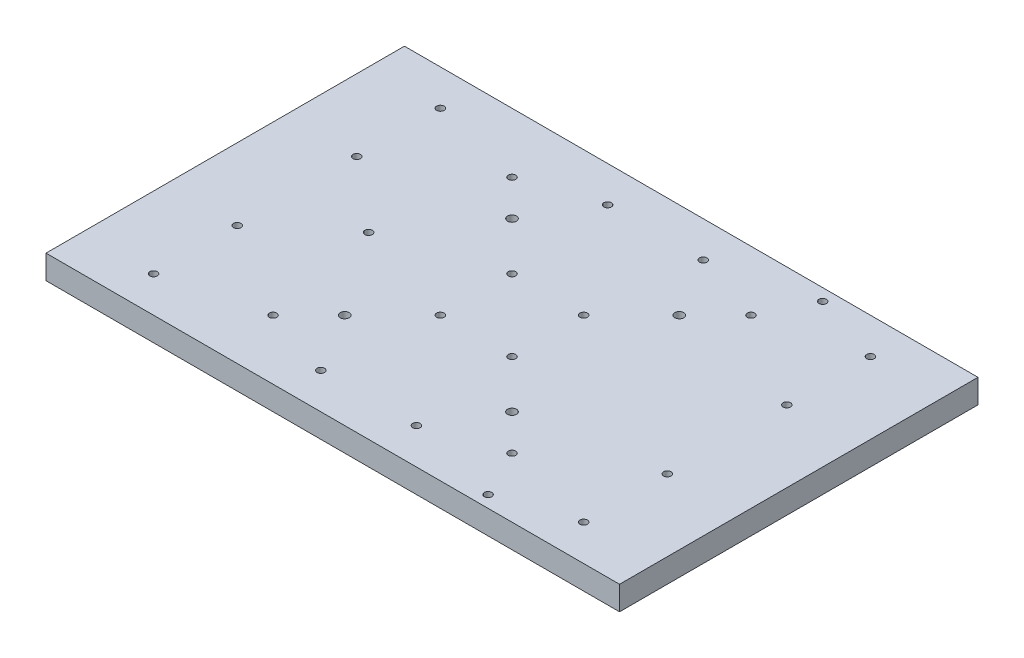
ISO-10303-21;
HEADER;
FILE_DESCRIPTION(('STEP AP214'),'2;1');
FILE_NAME('part.step','',(''),(''),'','','');
FILE_SCHEMA(('AUTOMOTIVE_DESIGN { 1 0 10303 214 1 1 1 1 }'));
ENDSEC;
DATA;
#1=APPLICATION_CONTEXT('core data for automotive mechanical design processes');
#2=APPLICATION_PROTOCOL_DEFINITION('international standard','automotive_design',2000,#1);
#3=PRODUCT_CONTEXT('',#1,'mechanical');
#4=PRODUCT('Part','Part','',(#3));
#5=PRODUCT_RELATED_PRODUCT_CATEGORY('part','',(#4));
#6=PRODUCT_DEFINITION_FORMATION('','',#4);
#7=PRODUCT_DEFINITION_CONTEXT('part definition',#1,'design');
#8=PRODUCT_DEFINITION('design','',#6,#7);
#9=PRODUCT_DEFINITION_SHAPE('','',#8);
#10=(LENGTH_UNIT() NAMED_UNIT(*) SI_UNIT(.MILLI.,.METRE.));
#11=(NAMED_UNIT(*) PLANE_ANGLE_UNIT() SI_UNIT($,.RADIAN.));
#12=(NAMED_UNIT(*) SI_UNIT($,.STERADIAN.) SOLID_ANGLE_UNIT());
#13=UNCERTAINTY_MEASURE_WITH_UNIT(LENGTH_MEASURE(1.E-05),#10,'distance_accuracy_value','');
#14=(GEOMETRIC_REPRESENTATION_CONTEXT(3) GLOBAL_UNCERTAINTY_ASSIGNED_CONTEXT((#13)) GLOBAL_UNIT_ASSIGNED_CONTEXT((#10,
#11,#12)) REPRESENTATION_CONTEXT('',''));
#15=CARTESIAN_POINT('',(0.,0.,0.));
#16=DIRECTION('',(0.,0.,1.));
#17=DIRECTION('',(1.,0.,0.));
#18=AXIS2_PLACEMENT_3D('',#15,#16,#17);
#19=CARTESIAN_POINT('',(304.8,12.7,-190.5));
#20=DIRECTION('',(-1.,0.,0.));
#21=DIRECTION('',(0.,0.,1.));
#22=AXIS2_PLACEMENT_3D('',#19,#20,#21);
#23=PLANE('',#22);
#24=DIRECTION('',(0.,0.,-1.));
#25=VECTOR('',#24,1.);
#26=CARTESIAN_POINT('',(304.8,-12.7,-190.5));
#27=LINE('',#26,#25);
#28=CARTESIAN_POINT('',(304.8,-12.7,190.5));
#29=VERTEX_POINT('',#28);
#30=CARTESIAN_POINT('',(304.8,-12.7,-190.5));
#31=VERTEX_POINT('',#30);
#32=EDGE_CURVE('E98',#29,#31,#27,.T.);
#33=ORIENTED_EDGE('',*,*,#32,.T.);
#34=DIRECTION('',(0.,-1.,0.));
#35=VECTOR('',#34,1.);
#36=CARTESIAN_POINT('',(304.8,12.7,-190.5));
#37=LINE('',#36,#35);
#38=CARTESIAN_POINT('',(304.8,12.7,-190.5));
#39=VERTEX_POINT('',#38);
#40=EDGE_CURVE('E11',#39,#31,#37,.T.);
#41=ORIENTED_EDGE('',*,*,#40,.F.);
#42=DIRECTION('',(0.,0.,-1.));
#43=VECTOR('',#42,1.);
#44=CARTESIAN_POINT('',(304.8,12.7,-190.5));
#45=LINE('',#44,#43);
#46=CARTESIAN_POINT('',(304.8,12.7,190.5));
#47=VERTEX_POINT('',#46);
#48=EDGE_CURVE('E86',#47,#39,#45,.T.);
#49=ORIENTED_EDGE('',*,*,#48,.F.);
#50=DIRECTION('',(0.,-1.,0.));
#51=VECTOR('',#50,1.);
#52=CARTESIAN_POINT('',(304.8,12.7,190.5));
#53=LINE('',#52,#51);
#54=EDGE_CURVE('E94',#47,#29,#53,.T.);
#55=ORIENTED_EDGE('',*,*,#54,.T.);
#56=EDGE_LOOP('',(#33,#41,#49,#55));
#57=FACE_BOUND('',#56,.T.);
#58=ADVANCED_FACE('F35',(#57),#23,.F.);
#59=CARTESIAN_POINT('',(-304.8,12.7,-190.5));
#60=DIRECTION('',(0.,0.,1.));
#61=DIRECTION('',(1.,0.,0.));
#62=AXIS2_PLACEMENT_3D('',#59,#60,#61);
#63=PLANE('',#62);
#64=DIRECTION('',(-1.,0.,0.));
#65=VECTOR('',#64,1.);
#66=CARTESIAN_POINT('',(-304.8,-12.7,-190.5));
#67=LINE('',#66,#65);
#68=CARTESIAN_POINT('',(-304.8,-12.7,-190.5));
#69=VERTEX_POINT('',#68);
#70=EDGE_CURVE('E90',#31,#69,#67,.T.);
#71=ORIENTED_EDGE('',*,*,#70,.T.);
#72=DIRECTION('',(0.,-1.,0.));
#73=VECTOR('',#72,1.);
#74=CARTESIAN_POINT('',(-304.8,12.7,-190.5));
#75=LINE('',#74,#73);
#76=CARTESIAN_POINT('',(-304.8,12.7,-190.5));
#77=VERTEX_POINT('',#76);
#78=EDGE_CURVE('E43',#77,#69,#75,.T.);
#79=ORIENTED_EDGE('',*,*,#78,.F.);
#80=DIRECTION('',(-1.,0.,0.));
#81=VECTOR('',#80,1.);
#82=CARTESIAN_POINT('',(-304.8,12.7,-190.5));
#83=LINE('',#82,#81);
#84=EDGE_CURVE('E81',#39,#77,#83,.T.);
#85=ORIENTED_EDGE('',*,*,#84,.F.);
#86=ORIENTED_EDGE('',*,*,#40,.T.);
#87=EDGE_LOOP('',(#71,#79,#85,#86));
#88=FACE_BOUND('',#87,.T.);
#89=ADVANCED_FACE('F89',(#88),#63,.F.);
#90=CARTESIAN_POINT('',(-304.8,12.7,-190.5));
#91=DIRECTION('',(1.,0.,0.));
#92=DIRECTION('',(0.,0.,-1.));
#93=AXIS2_PLACEMENT_3D('',#90,#91,#92);
#94=PLANE('',#93);
#95=DIRECTION('',(0.,0.,1.));
#96=VECTOR('',#95,1.);
#97=CARTESIAN_POINT('',(-304.8,-12.7,-190.5));
#98=LINE('',#97,#96);
#99=CARTESIAN_POINT('',(-304.8,-12.7,190.5));
#100=VERTEX_POINT('',#99);
#101=EDGE_CURVE('E68',#69,#100,#98,.T.);
#102=ORIENTED_EDGE('',*,*,#101,.T.);
#103=DIRECTION('',(0.,-1.,0.));
#104=VECTOR('',#103,1.);
#105=CARTESIAN_POINT('',(-304.8,12.7,190.5));
#106=LINE('',#105,#104);
#107=CARTESIAN_POINT('',(-304.8,12.7,190.5));
#108=VERTEX_POINT('',#107);
#109=EDGE_CURVE('E91',#108,#100,#106,.T.);
#110=ORIENTED_EDGE('',*,*,#109,.F.);
#111=DIRECTION('',(0.,0.,1.));
#112=VECTOR('',#111,1.);
#113=CARTESIAN_POINT('',(-304.8,12.7,-190.5));
#114=LINE('',#113,#112);
#115=EDGE_CURVE('E84',#77,#108,#114,.T.);
#116=ORIENTED_EDGE('',*,*,#115,.F.);
#117=ORIENTED_EDGE('',*,*,#78,.T.);
#118=EDGE_LOOP('',(#102,#110,#116,#117));
#119=FACE_BOUND('',#118,.T.);
#120=ADVANCED_FACE('F92',(#119),#94,.F.);
#121=CARTESIAN_POINT('',(-304.8,12.7,190.5));
#122=DIRECTION('',(0.,0.,-1.));
#123=DIRECTION('',(-1.,0.,0.));
#124=AXIS2_PLACEMENT_3D('',#121,#122,#123);
#125=PLANE('',#124);
#126=DIRECTION('',(1.,0.,0.));
#127=VECTOR('',#126,1.);
#128=CARTESIAN_POINT('',(-304.8,-12.7,190.5));
#129=LINE('',#128,#127);
#130=EDGE_CURVE('E74',#100,#29,#129,.T.);
#131=ORIENTED_EDGE('',*,*,#130,.T.);
#132=ORIENTED_EDGE('',*,*,#54,.F.);
#133=DIRECTION('',(1.,0.,0.));
#134=VECTOR('',#133,1.);
#135=CARTESIAN_POINT('',(-304.8,12.7,190.5));
#136=LINE('',#135,#134);
#137=EDGE_CURVE('E51',#108,#47,#136,.T.);
#138=ORIENTED_EDGE('',*,*,#137,.F.);
#139=ORIENTED_EDGE('',*,*,#109,.T.);
#140=EDGE_LOOP('',(#131,#132,#138,#139));
#141=FACE_BOUND('',#140,.T.);
#142=ADVANCED_FACE('F106',(#141),#125,.F.);
#143=CARTESIAN_POINT('',(0.,12.7,0.));
#144=DIRECTION('',(0.,1.,0.));
#145=DIRECTION('',(0.,0.,1.));
#146=AXIS2_PLACEMENT_3D('',#143,#144,#145);
#147=PLANE('',#146);
#148=CARTESIAN_POINT('',(-127.,12.7,127.));
#149=DIRECTION('',(0.,1.,0.));
#150=DIRECTION('',(0.,0.,1.));
#151=AXIS2_PLACEMENT_3D('',#148,#149,#150);
#152=CIRCLE('',#151,3.96874999999999);
#153=CARTESIAN_POINT('',(-127.,12.7,130.96875));
#154=VERTEX_POINT('',#153);
#155=EDGE_CURVE('E270',#154,#154,#152,.T.);
#156=ORIENTED_EDGE('',*,*,#155,.F.);
#157=EDGE_LOOP('',(#156));
#158=FACE_BOUND('',#157,.T.);
#159=CARTESIAN_POINT('',(-38.1,12.7,38.1));
#160=DIRECTION('',(0.,1.,0.));
#161=DIRECTION('',(0.,0.,1.));
#162=AXIS2_PLACEMENT_3D('',#159,#160,#161);
#163=CIRCLE('',#162,3.96874999999999);
#164=CARTESIAN_POINT('',(-38.1,12.7,42.06875));
#165=VERTEX_POINT('',#164);
#166=EDGE_CURVE('E264',#165,#165,#163,.T.);
#167=ORIENTED_EDGE('',*,*,#166,.F.);
#168=EDGE_LOOP('',(#167));
#169=FACE_BOUND('',#168,.T.);
#170=CARTESIAN_POINT('',(-228.6,12.7,63.5));
#171=DIRECTION('',(0.,1.,0.));
#172=DIRECTION('',(0.,0.,1.));
#173=AXIS2_PLACEMENT_3D('',#170,#171,#172);
#174=CIRCLE('',#173,3.96874999999999);
#175=CARTESIAN_POINT('',(-228.6,12.7,67.46875));
#176=VERTEX_POINT('',#175);
#177=EDGE_CURVE('E258',#176,#176,#174,.T.);
#178=ORIENTED_EDGE('',*,*,#177,.F.);
#179=EDGE_LOOP('',(#178));
#180=FACE_BOUND('',#179,.T.);
#181=CARTESIAN_POINT('',(-228.6,12.7,152.4));
#182=DIRECTION('',(0.,1.,0.));
#183=DIRECTION('',(0.,0.,1.));
#184=AXIS2_PLACEMENT_3D('',#181,#182,#183);
#185=CIRCLE('',#184,3.96874999999999);
#186=CARTESIAN_POINT('',(-228.6,12.7,156.36875));
#187=VERTEX_POINT('',#186);
#188=EDGE_CURVE('E252',#187,#187,#185,.T.);
#189=ORIENTED_EDGE('',*,*,#188,.F.);
#190=EDGE_LOOP('',(#189));
#191=FACE_BOUND('',#190,.T.);
#192=CARTESIAN_POINT('',(-50.8,12.7,152.4));
#193=DIRECTION('',(0.,1.,0.));
#194=DIRECTION('',(0.,0.,1.));
#195=AXIS2_PLACEMENT_3D('',#192,#193,#194);
#196=CIRCLE('',#195,3.96874999999999);
#197=CARTESIAN_POINT('',(-50.8,12.7,156.36875));
#198=VERTEX_POINT('',#197);
#199=EDGE_CURVE('E246',#198,#198,#196,.T.);
#200=ORIENTED_EDGE('',*,*,#199,.F.);
#201=EDGE_LOOP('',(#200));
#202=FACE_BOUND('',#201,.T.);
#203=CARTESIAN_POINT('',(-88.9,12.7,88.9));
#204=DIRECTION('',(0.,1.,0.));
#205=DIRECTION('',(0.,0.,-1.));
#206=AXIS2_PLACEMENT_3D('',#203,#204,#205);
#207=CIRCLE('',#206,4.7625);
#208=CARTESIAN_POINT('',(-88.9,12.7,84.1375));
#209=VERTEX_POINT('',#208);
#210=EDGE_CURVE('E238',#209,#209,#207,.T.);
#211=ORIENTED_EDGE('',*,*,#210,.F.);
#212=EDGE_LOOP('',(#211));
#213=FACE_BOUND('',#212,.T.);
#214=CARTESIAN_POINT('',(-127.,12.7,-127.));
#215=DIRECTION('',(0.,1.,0.));
#216=DIRECTION('',(0.,0.,1.));
#217=AXIS2_PLACEMENT_3D('',#214,#215,#216);
#218=CIRCLE('',#217,3.96874999999999);
#219=CARTESIAN_POINT('',(-127.,12.7,-123.03125));
#220=VERTEX_POINT('',#219);
#221=EDGE_CURVE('E234',#220,#220,#218,.T.);
#222=ORIENTED_EDGE('',*,*,#221,.F.);
#223=EDGE_LOOP('',(#222));
#224=FACE_BOUND('',#223,.T.);
#225=CARTESIAN_POINT('',(-38.1,12.7,-38.1));
#226=DIRECTION('',(0.,1.,0.));
#227=DIRECTION('',(0.,0.,1.));
#228=AXIS2_PLACEMENT_3D('',#225,#226,#227);
#229=CIRCLE('',#228,3.96874999999999);
#230=CARTESIAN_POINT('',(-38.1,12.7,-34.13125));
#231=VERTEX_POINT('',#230);
#232=EDGE_CURVE('E228',#231,#231,#229,.T.);
#233=ORIENTED_EDGE('',*,*,#232,.F.);
#234=EDGE_LOOP('',(#233));
#235=FACE_BOUND('',#234,.T.);
#236=CARTESIAN_POINT('',(-228.6,12.7,-63.5));
#237=DIRECTION('',(0.,1.,0.));
#238=DIRECTION('',(0.,0.,1.));
#239=AXIS2_PLACEMENT_3D('',#236,#237,#238);
#240=CIRCLE('',#239,3.96874999999999);
#241=CARTESIAN_POINT('',(-228.6,12.7,-59.53125));
#242=VERTEX_POINT('',#241);
#243=EDGE_CURVE('E222',#242,#242,#240,.T.);
#244=ORIENTED_EDGE('',*,*,#243,.F.);
#245=EDGE_LOOP('',(#244));
#246=FACE_BOUND('',#245,.T.);
#247=CARTESIAN_POINT('',(-228.6,12.7,-152.4));
#248=DIRECTION('',(0.,1.,0.));
#249=DIRECTION('',(0.,0.,1.));
#250=AXIS2_PLACEMENT_3D('',#247,#248,#249);
#251=CIRCLE('',#250,3.96874999999999);
#252=CARTESIAN_POINT('',(-228.6,12.7,-148.43125));
#253=VERTEX_POINT('',#252);
#254=EDGE_CURVE('E216',#253,#253,#251,.T.);
#255=ORIENTED_EDGE('',*,*,#254,.F.);
#256=EDGE_LOOP('',(#255));
#257=FACE_BOUND('',#256,.T.);
#258=CARTESIAN_POINT('',(-50.8,12.7,-152.4));
#259=DIRECTION('',(0.,1.,0.));
#260=DIRECTION('',(0.,0.,1.));
#261=AXIS2_PLACEMENT_3D('',#258,#259,#260);
#262=CIRCLE('',#261,3.96874999999999);
#263=CARTESIAN_POINT('',(-50.8,12.7,-148.43125));
#264=VERTEX_POINT('',#263);
#265=EDGE_CURVE('E210',#264,#264,#262,.T.);
#266=ORIENTED_EDGE('',*,*,#265,.F.);
#267=EDGE_LOOP('',(#266));
#268=FACE_BOUND('',#267,.T.);
#269=CARTESIAN_POINT('',(-88.9,12.7,-88.9));
#270=DIRECTION('',(0.,-1.,0.));
#271=DIRECTION('',(0.,0.,1.));
#272=AXIS2_PLACEMENT_3D('',#269,#270,#271);
#273=CIRCLE('',#272,4.7625);
#274=CARTESIAN_POINT('',(-88.9,12.7,-84.1375));
#275=VERTEX_POINT('',#274);
#276=EDGE_CURVE('E202',#275,#275,#273,.T.);
#277=ORIENTED_EDGE('',*,*,#276,.T.);
#278=EDGE_LOOP('',(#277));
#279=FACE_BOUND('',#278,.T.);
#280=CARTESIAN_POINT('',(127.,12.7,127.));
#281=DIRECTION('',(0.,1.,0.));
#282=DIRECTION('',(0.,0.,1.));
#283=AXIS2_PLACEMENT_3D('',#280,#281,#282);
#284=CIRCLE('',#283,3.96874999999999);
#285=CARTESIAN_POINT('',(127.,12.7,130.96875));
#286=VERTEX_POINT('',#285);
#287=EDGE_CURVE('E198',#286,#286,#284,.T.);
#288=ORIENTED_EDGE('',*,*,#287,.F.);
#289=EDGE_LOOP('',(#288));
#290=FACE_BOUND('',#289,.T.);
#291=CARTESIAN_POINT('',(38.1,12.7,38.1));
#292=DIRECTION('',(0.,1.,0.));
#293=DIRECTION('',(0.,0.,1.));
#294=AXIS2_PLACEMENT_3D('',#291,#292,#293);
#295=CIRCLE('',#294,3.96874999999999);
#296=CARTESIAN_POINT('',(38.1,12.7,42.06875));
#297=VERTEX_POINT('',#296);
#298=EDGE_CURVE('E192',#297,#297,#295,.T.);
#299=ORIENTED_EDGE('',*,*,#298,.F.);
#300=EDGE_LOOP('',(#299));
#301=FACE_BOUND('',#300,.T.);
#302=CARTESIAN_POINT('',(228.6,12.7,63.5));
#303=DIRECTION('',(0.,1.,0.));
#304=DIRECTION('',(0.,0.,1.));
#305=AXIS2_PLACEMENT_3D('',#302,#303,#304);
#306=CIRCLE('',#305,3.96874999999999);
#307=CARTESIAN_POINT('',(228.6,12.7,67.46875));
#308=VERTEX_POINT('',#307);
#309=EDGE_CURVE('E186',#308,#308,#306,.T.);
#310=ORIENTED_EDGE('',*,*,#309,.F.);
#311=EDGE_LOOP('',(#310));
#312=FACE_BOUND('',#311,.T.);
#313=CARTESIAN_POINT('',(228.6,12.7,152.4));
#314=DIRECTION('',(0.,1.,0.));
#315=DIRECTION('',(0.,0.,1.));
#316=AXIS2_PLACEMENT_3D('',#313,#314,#315);
#317=CIRCLE('',#316,3.96874999999999);
#318=CARTESIAN_POINT('',(228.6,12.7,156.36875));
#319=VERTEX_POINT('',#318);
#320=EDGE_CURVE('E180',#319,#319,#317,.T.);
#321=ORIENTED_EDGE('',*,*,#320,.F.);
#322=EDGE_LOOP('',(#321));
#323=FACE_BOUND('',#322,.T.);
#324=CARTESIAN_POINT('',(50.8,12.7,152.4));
#325=DIRECTION('',(0.,1.,0.));
#326=DIRECTION('',(0.,0.,1.));
#327=AXIS2_PLACEMENT_3D('',#324,#325,#326);
#328=CIRCLE('',#327,3.96874999999999);
#329=CARTESIAN_POINT('',(50.8,12.7,156.36875));
#330=VERTEX_POINT('',#329);
#331=EDGE_CURVE('E174',#330,#330,#328,.T.);
#332=ORIENTED_EDGE('',*,*,#331,.F.);
#333=EDGE_LOOP('',(#332));
#334=FACE_BOUND('',#333,.T.);
#335=CARTESIAN_POINT('',(88.9,12.7,88.9));
#336=DIRECTION('',(0.,-1.,0.));
#337=DIRECTION('',(0.,0.,-1.));
#338=AXIS2_PLACEMENT_3D('',#335,#336,#337);
#339=CIRCLE('',#338,4.7625);
#340=CARTESIAN_POINT('',(88.9,12.7,84.1375));
#341=VERTEX_POINT('',#340);
#342=EDGE_CURVE('E166',#341,#341,#339,.T.);
#343=ORIENTED_EDGE('',*,*,#342,.T.);
#344=EDGE_LOOP('',(#343));
#345=FACE_BOUND('',#344,.T.);
#346=CARTESIAN_POINT('',(152.4,12.7,-177.8));
#347=DIRECTION('',(0.,1.,0.));
#348=DIRECTION('',(0.,0.,1.));
#349=AXIS2_PLACEMENT_3D('',#346,#347,#348);
#350=CIRCLE('',#349,3.96874999999999);
#351=CARTESIAN_POINT('',(152.4,12.7,-173.83125));
#352=VERTEX_POINT('',#351);
#353=EDGE_CURVE('E162',#352,#352,#350,.T.);
#354=ORIENTED_EDGE('',*,*,#353,.F.);
#355=EDGE_LOOP('',(#354));
#356=FACE_BOUND('',#355,.T.);
#357=CARTESIAN_POINT('',(152.4,12.7,177.8));
#358=DIRECTION('',(0.,1.,0.));
#359=DIRECTION('',(0.,0.,1.));
#360=AXIS2_PLACEMENT_3D('',#357,#358,#359);
#361=CIRCLE('',#360,3.96874999999999);
#362=CARTESIAN_POINT('',(152.4,12.7,181.76875));
#363=VERTEX_POINT('',#362);
#364=EDGE_CURVE('E156',#363,#363,#361,.T.);
#365=ORIENTED_EDGE('',*,*,#364,.F.);
#366=EDGE_LOOP('',(#365));
#367=FACE_BOUND('',#366,.T.);
#368=CARTESIAN_POINT('',(-152.4,12.7,0.));
#369=DIRECTION('',(0.,1.,0.));
#370=DIRECTION('',(0.,0.,1.));
#371=AXIS2_PLACEMENT_3D('',#368,#369,#370);
#372=CIRCLE('',#371,3.96874999999999);
#373=CARTESIAN_POINT('',(-152.4,12.7,3.96874999999999));
#374=VERTEX_POINT('',#373);
#375=EDGE_CURVE('E150',#374,#374,#372,.T.);
#376=ORIENTED_EDGE('',*,*,#375,.F.);
#377=EDGE_LOOP('',(#376));
#378=FACE_BOUND('',#377,.T.);
#379=CARTESIAN_POINT('',(127.,12.7,-127.));
#380=DIRECTION('',(0.,1.,0.));
#381=DIRECTION('',(0.,0.,1.));
#382=AXIS2_PLACEMENT_3D('',#379,#380,#381);
#383=CIRCLE('',#382,3.96874999999999);
#384=CARTESIAN_POINT('',(127.,12.7,-123.03125));
#385=VERTEX_POINT('',#384);
#386=EDGE_CURVE('E144',#385,#385,#383,.T.);
#387=ORIENTED_EDGE('',*,*,#386,.F.);
#388=EDGE_LOOP('',(#387));
#389=FACE_BOUND('',#388,.T.);
#390=CARTESIAN_POINT('',(38.1,12.7,-38.1));
#391=DIRECTION('',(0.,1.,0.));
#392=DIRECTION('',(0.,0.,1.));
#393=AXIS2_PLACEMENT_3D('',#390,#391,#392);
#394=CIRCLE('',#393,3.96874999999999);
#395=CARTESIAN_POINT('',(38.1,12.7,-34.13125));
#396=VERTEX_POINT('',#395);
#397=EDGE_CURVE('E138',#396,#396,#394,.T.);
#398=ORIENTED_EDGE('',*,*,#397,.F.);
#399=EDGE_LOOP('',(#398));
#400=FACE_BOUND('',#399,.T.);
#401=CARTESIAN_POINT('',(228.6,12.7,-63.5));
#402=DIRECTION('',(0.,1.,0.));
#403=DIRECTION('',(0.,0.,1.));
#404=AXIS2_PLACEMENT_3D('',#401,#402,#403);
#405=CIRCLE('',#404,3.96874999999999);
#406=CARTESIAN_POINT('',(228.6,12.7,-59.53125));
#407=VERTEX_POINT('',#406);
#408=EDGE_CURVE('E132',#407,#407,#405,.T.);
#409=ORIENTED_EDGE('',*,*,#408,.F.);
#410=EDGE_LOOP('',(#409));
#411=FACE_BOUND('',#410,.T.);
#412=CARTESIAN_POINT('',(228.6,12.7,-152.4));
#413=DIRECTION('',(0.,1.,0.));
#414=DIRECTION('',(0.,0.,1.));
#415=AXIS2_PLACEMENT_3D('',#412,#413,#414);
#416=CIRCLE('',#415,3.96874999999999);
#417=CARTESIAN_POINT('',(228.6,12.7,-148.43125));
#418=VERTEX_POINT('',#417);
#419=EDGE_CURVE('E126',#418,#418,#416,.T.);
#420=ORIENTED_EDGE('',*,*,#419,.F.);
#421=EDGE_LOOP('',(#420));
#422=FACE_BOUND('',#421,.T.);
#423=CARTESIAN_POINT('',(50.8,12.7,-152.4));
#424=DIRECTION('',(0.,1.,0.));
#425=DIRECTION('',(0.,0.,1.));
#426=AXIS2_PLACEMENT_3D('',#423,#424,#425);
#427=CIRCLE('',#426,3.96874999999999);
#428=CARTESIAN_POINT('',(50.8,12.7,-148.43125));
#429=VERTEX_POINT('',#428);
#430=EDGE_CURVE('E120',#429,#429,#427,.T.);
#431=ORIENTED_EDGE('',*,*,#430,.F.);
#432=EDGE_LOOP('',(#431));
#433=FACE_BOUND('',#432,.T.);
#434=CARTESIAN_POINT('',(88.9,12.7,-88.9));
#435=DIRECTION('',(0.,1.,0.));
#436=DIRECTION('',(0.,0.,1.));
#437=AXIS2_PLACEMENT_3D('',#434,#435,#436);
#438=CIRCLE('',#437,4.7625);
#439=CARTESIAN_POINT('',(88.9,12.7,-84.1375));
#440=VERTEX_POINT('',#439);
#441=EDGE_CURVE('E112',#440,#440,#438,.T.);
#442=ORIENTED_EDGE('',*,*,#441,.F.);
#443=EDGE_LOOP('',(#442));
#444=FACE_BOUND('',#443,.T.);
#445=ORIENTED_EDGE('',*,*,#48,.T.);
#446=ORIENTED_EDGE('',*,*,#84,.T.);
#447=ORIENTED_EDGE('',*,*,#115,.T.);
#448=ORIENTED_EDGE('',*,*,#137,.T.);
#449=EDGE_LOOP('',(#445,#446,#447,#448));
#450=FACE_BOUND('',#449,.T.);
#451=ADVANCED_FACE('F82',(#158,#169,#180,#191,#202,#213,#224,#235,#246,#257,#268,#279,#290,#301,
#312,#323,#334,#345,#356,#367,#378,#389,#400,#411,#422,#433,#444,#450),#147,.T.);
#452=CARTESIAN_POINT('',(0.,-12.7,0.));
#453=DIRECTION('',(0.,1.,0.));
#454=DIRECTION('',(0.,0.,1.));
#455=AXIS2_PLACEMENT_3D('',#452,#453,#454);
#456=PLANE('',#455);
#457=CARTESIAN_POINT('',(-127.,-12.7,127.));
#458=DIRECTION('',(0.,1.,0.));
#459=DIRECTION('',(0.,0.,1.));
#460=AXIS2_PLACEMENT_3D('',#457,#458,#459);
#461=CIRCLE('',#460,3.96874999999999);
#462=CARTESIAN_POINT('',(-127.,-12.7,130.96875));
#463=VERTEX_POINT('',#462);
#464=EDGE_CURVE('E267',#463,#463,#461,.T.);
#465=ORIENTED_EDGE('',*,*,#464,.T.);
#466=EDGE_LOOP('',(#465));
#467=FACE_BOUND('',#466,.T.);
#468=CARTESIAN_POINT('',(-38.1,-12.7,38.1));
#469=DIRECTION('',(0.,1.,0.));
#470=DIRECTION('',(0.,0.,1.));
#471=AXIS2_PLACEMENT_3D('',#468,#469,#470);
#472=CIRCLE('',#471,3.96874999999999);
#473=CARTESIAN_POINT('',(-38.1,-12.7,42.06875));
#474=VERTEX_POINT('',#473);
#475=EDGE_CURVE('E261',#474,#474,#472,.T.);
#476=ORIENTED_EDGE('',*,*,#475,.T.);
#477=EDGE_LOOP('',(#476));
#478=FACE_BOUND('',#477,.T.);
#479=CARTESIAN_POINT('',(-228.6,-12.7,63.5));
#480=DIRECTION('',(0.,1.,0.));
#481=DIRECTION('',(0.,0.,1.));
#482=AXIS2_PLACEMENT_3D('',#479,#480,#481);
#483=CIRCLE('',#482,3.96874999999999);
#484=CARTESIAN_POINT('',(-228.6,-12.7,67.46875));
#485=VERTEX_POINT('',#484);
#486=EDGE_CURVE('E255',#485,#485,#483,.T.);
#487=ORIENTED_EDGE('',*,*,#486,.T.);
#488=EDGE_LOOP('',(#487));
#489=FACE_BOUND('',#488,.T.);
#490=CARTESIAN_POINT('',(-228.6,-12.7,152.4));
#491=DIRECTION('',(0.,1.,0.));
#492=DIRECTION('',(0.,0.,1.));
#493=AXIS2_PLACEMENT_3D('',#490,#491,#492);
#494=CIRCLE('',#493,3.96874999999999);
#495=CARTESIAN_POINT('',(-228.6,-12.7,156.36875));
#496=VERTEX_POINT('',#495);
#497=EDGE_CURVE('E249',#496,#496,#494,.T.);
#498=ORIENTED_EDGE('',*,*,#497,.T.);
#499=EDGE_LOOP('',(#498));
#500=FACE_BOUND('',#499,.T.);
#501=CARTESIAN_POINT('',(-50.8,-12.7,152.4));
#502=DIRECTION('',(0.,1.,0.));
#503=DIRECTION('',(0.,0.,1.));
#504=AXIS2_PLACEMENT_3D('',#501,#502,#503);
#505=CIRCLE('',#504,3.96874999999999);
#506=CARTESIAN_POINT('',(-50.8,-12.7,156.36875));
#507=VERTEX_POINT('',#506);
#508=EDGE_CURVE('E241',#507,#507,#505,.T.);
#509=ORIENTED_EDGE('',*,*,#508,.T.);
#510=EDGE_LOOP('',(#509));
#511=FACE_BOUND('',#510,.T.);
#512=CARTESIAN_POINT('',(-88.9,-12.7,88.9));
#513=DIRECTION('',(0.,1.,0.));
#514=DIRECTION('',(0.,0.,-1.));
#515=AXIS2_PLACEMENT_3D('',#512,#513,#514);
#516=CIRCLE('',#515,4.7625);
#517=CARTESIAN_POINT('',(-88.9,-12.7,84.1375));
#518=VERTEX_POINT('',#517);
#519=EDGE_CURVE('E237',#518,#518,#516,.T.);
#520=ORIENTED_EDGE('',*,*,#519,.T.);
#521=EDGE_LOOP('',(#520));
#522=FACE_BOUND('',#521,.T.);
#523=CARTESIAN_POINT('',(-127.,-12.7,-127.));
#524=DIRECTION('',(0.,1.,0.));
#525=DIRECTION('',(0.,0.,1.));
#526=AXIS2_PLACEMENT_3D('',#523,#524,#525);
#527=CIRCLE('',#526,3.96874999999999);
#528=CARTESIAN_POINT('',(-127.,-12.7,-123.03125));
#529=VERTEX_POINT('',#528);
#530=EDGE_CURVE('E231',#529,#529,#527,.T.);
#531=ORIENTED_EDGE('',*,*,#530,.T.);
#532=EDGE_LOOP('',(#531));
#533=FACE_BOUND('',#532,.T.);
#534=CARTESIAN_POINT('',(-38.1,-12.7,-38.1));
#535=DIRECTION('',(0.,1.,0.));
#536=DIRECTION('',(0.,0.,1.));
#537=AXIS2_PLACEMENT_3D('',#534,#535,#536);
#538=CIRCLE('',#537,3.96874999999999);
#539=CARTESIAN_POINT('',(-38.1,-12.7,-34.13125));
#540=VERTEX_POINT('',#539);
#541=EDGE_CURVE('E225',#540,#540,#538,.T.);
#542=ORIENTED_EDGE('',*,*,#541,.T.);
#543=EDGE_LOOP('',(#542));
#544=FACE_BOUND('',#543,.T.);
#545=CARTESIAN_POINT('',(-228.6,-12.7,-63.5));
#546=DIRECTION('',(0.,1.,0.));
#547=DIRECTION('',(0.,0.,1.));
#548=AXIS2_PLACEMENT_3D('',#545,#546,#547);
#549=CIRCLE('',#548,3.96874999999999);
#550=CARTESIAN_POINT('',(-228.6,-12.7,-59.53125));
#551=VERTEX_POINT('',#550);
#552=EDGE_CURVE('E219',#551,#551,#549,.T.);
#553=ORIENTED_EDGE('',*,*,#552,.T.);
#554=EDGE_LOOP('',(#553));
#555=FACE_BOUND('',#554,.T.);
#556=CARTESIAN_POINT('',(-228.6,-12.7,-152.4));
#557=DIRECTION('',(0.,1.,0.));
#558=DIRECTION('',(0.,0.,1.));
#559=AXIS2_PLACEMENT_3D('',#556,#557,#558);
#560=CIRCLE('',#559,3.96874999999999);
#561=CARTESIAN_POINT('',(-228.6,-12.7,-148.43125));
#562=VERTEX_POINT('',#561);
#563=EDGE_CURVE('E213',#562,#562,#560,.T.);
#564=ORIENTED_EDGE('',*,*,#563,.T.);
#565=EDGE_LOOP('',(#564));
#566=FACE_BOUND('',#565,.T.);
#567=CARTESIAN_POINT('',(-50.8,-12.7,-152.4));
#568=DIRECTION('',(0.,1.,0.));
#569=DIRECTION('',(0.,0.,1.));
#570=AXIS2_PLACEMENT_3D('',#567,#568,#569);
#571=CIRCLE('',#570,3.96874999999999);
#572=CARTESIAN_POINT('',(-50.8,-12.7,-148.43125));
#573=VERTEX_POINT('',#572);
#574=EDGE_CURVE('E205',#573,#573,#571,.T.);
#575=ORIENTED_EDGE('',*,*,#574,.T.);
#576=EDGE_LOOP('',(#575));
#577=FACE_BOUND('',#576,.T.);
#578=CARTESIAN_POINT('',(-88.9,-12.7,-88.9));
#579=DIRECTION('',(0.,-1.,0.));
#580=DIRECTION('',(0.,0.,1.));
#581=AXIS2_PLACEMENT_3D('',#578,#579,#580);
#582=CIRCLE('',#581,4.7625);
#583=CARTESIAN_POINT('',(-88.9,-12.7,-84.1375));
#584=VERTEX_POINT('',#583);
#585=EDGE_CURVE('E201',#584,#584,#582,.T.);
#586=ORIENTED_EDGE('',*,*,#585,.F.);
#587=EDGE_LOOP('',(#586));
#588=FACE_BOUND('',#587,.T.);
#589=CARTESIAN_POINT('',(127.,-12.7,127.));
#590=DIRECTION('',(0.,1.,0.));
#591=DIRECTION('',(0.,0.,1.));
#592=AXIS2_PLACEMENT_3D('',#589,#590,#591);
#593=CIRCLE('',#592,3.96874999999999);
#594=CARTESIAN_POINT('',(127.,-12.7,130.96875));
#595=VERTEX_POINT('',#594);
#596=EDGE_CURVE('E195',#595,#595,#593,.T.);
#597=ORIENTED_EDGE('',*,*,#596,.T.);
#598=EDGE_LOOP('',(#597));
#599=FACE_BOUND('',#598,.T.);
#600=CARTESIAN_POINT('',(38.1,-12.7,38.1));
#601=DIRECTION('',(0.,1.,0.));
#602=DIRECTION('',(0.,0.,1.));
#603=AXIS2_PLACEMENT_3D('',#600,#601,#602);
#604=CIRCLE('',#603,3.96874999999999);
#605=CARTESIAN_POINT('',(38.1,-12.7,42.06875));
#606=VERTEX_POINT('',#605);
#607=EDGE_CURVE('E189',#606,#606,#604,.T.);
#608=ORIENTED_EDGE('',*,*,#607,.T.);
#609=EDGE_LOOP('',(#608));
#610=FACE_BOUND('',#609,.T.);
#611=CARTESIAN_POINT('',(228.6,-12.7,63.5));
#612=DIRECTION('',(0.,1.,0.));
#613=DIRECTION('',(0.,0.,1.));
#614=AXIS2_PLACEMENT_3D('',#611,#612,#613);
#615=CIRCLE('',#614,3.96874999999999);
#616=CARTESIAN_POINT('',(228.6,-12.7,67.46875));
#617=VERTEX_POINT('',#616);
#618=EDGE_CURVE('E183',#617,#617,#615,.T.);
#619=ORIENTED_EDGE('',*,*,#618,.T.);
#620=EDGE_LOOP('',(#619));
#621=FACE_BOUND('',#620,.T.);
#622=CARTESIAN_POINT('',(228.6,-12.7,152.4));
#623=DIRECTION('',(0.,1.,0.));
#624=DIRECTION('',(0.,0.,1.));
#625=AXIS2_PLACEMENT_3D('',#622,#623,#624);
#626=CIRCLE('',#625,3.96874999999999);
#627=CARTESIAN_POINT('',(228.6,-12.7,156.36875));
#628=VERTEX_POINT('',#627);
#629=EDGE_CURVE('E177',#628,#628,#626,.T.);
#630=ORIENTED_EDGE('',*,*,#629,.T.);
#631=EDGE_LOOP('',(#630));
#632=FACE_BOUND('',#631,.T.);
#633=CARTESIAN_POINT('',(50.8,-12.7,152.4));
#634=DIRECTION('',(0.,1.,0.));
#635=DIRECTION('',(0.,0.,1.));
#636=AXIS2_PLACEMENT_3D('',#633,#634,#635);
#637=CIRCLE('',#636,3.96874999999999);
#638=CARTESIAN_POINT('',(50.8,-12.7,156.36875));
#639=VERTEX_POINT('',#638);
#640=EDGE_CURVE('E169',#639,#639,#637,.T.);
#641=ORIENTED_EDGE('',*,*,#640,.T.);
#642=EDGE_LOOP('',(#641));
#643=FACE_BOUND('',#642,.T.);
#644=CARTESIAN_POINT('',(88.9,-12.7,88.9));
#645=DIRECTION('',(0.,-1.,0.));
#646=DIRECTION('',(0.,0.,-1.));
#647=AXIS2_PLACEMENT_3D('',#644,#645,#646);
#648=CIRCLE('',#647,4.7625);
#649=CARTESIAN_POINT('',(88.9,-12.7,84.1375));
#650=VERTEX_POINT('',#649);
#651=EDGE_CURVE('E165',#650,#650,#648,.T.);
#652=ORIENTED_EDGE('',*,*,#651,.F.);
#653=EDGE_LOOP('',(#652));
#654=FACE_BOUND('',#653,.T.);
#655=CARTESIAN_POINT('',(152.4,-12.7,-177.8));
#656=DIRECTION('',(0.,1.,0.));
#657=DIRECTION('',(0.,0.,1.));
#658=AXIS2_PLACEMENT_3D('',#655,#656,#657);
#659=CIRCLE('',#658,3.96874999999999);
#660=CARTESIAN_POINT('',(152.4,-12.7,-173.83125));
#661=VERTEX_POINT('',#660);
#662=EDGE_CURVE('E159',#661,#661,#659,.T.);
#663=ORIENTED_EDGE('',*,*,#662,.T.);
#664=EDGE_LOOP('',(#663));
#665=FACE_BOUND('',#664,.T.);
#666=CARTESIAN_POINT('',(152.4,-12.7,177.8));
#667=DIRECTION('',(0.,1.,0.));
#668=DIRECTION('',(0.,0.,1.));
#669=AXIS2_PLACEMENT_3D('',#666,#667,#668);
#670=CIRCLE('',#669,3.96874999999999);
#671=CARTESIAN_POINT('',(152.4,-12.7,181.76875));
#672=VERTEX_POINT('',#671);
#673=EDGE_CURVE('E153',#672,#672,#670,.T.);
#674=ORIENTED_EDGE('',*,*,#673,.T.);
#675=EDGE_LOOP('',(#674));
#676=FACE_BOUND('',#675,.T.);
#677=CARTESIAN_POINT('',(-152.4,-12.7,0.));
#678=DIRECTION('',(0.,1.,0.));
#679=DIRECTION('',(0.,0.,1.));
#680=AXIS2_PLACEMENT_3D('',#677,#678,#679);
#681=CIRCLE('',#680,3.96874999999999);
#682=CARTESIAN_POINT('',(-152.4,-12.7,3.96874999999999));
#683=VERTEX_POINT('',#682);
#684=EDGE_CURVE('E147',#683,#683,#681,.T.);
#685=ORIENTED_EDGE('',*,*,#684,.T.);
#686=EDGE_LOOP('',(#685));
#687=FACE_BOUND('',#686,.T.);
#688=CARTESIAN_POINT('',(127.,-12.7,-127.));
#689=DIRECTION('',(0.,1.,0.));
#690=DIRECTION('',(0.,0.,1.));
#691=AXIS2_PLACEMENT_3D('',#688,#689,#690);
#692=CIRCLE('',#691,3.96874999999999);
#693=CARTESIAN_POINT('',(127.,-12.7,-123.03125));
#694=VERTEX_POINT('',#693);
#695=EDGE_CURVE('E141',#694,#694,#692,.T.);
#696=ORIENTED_EDGE('',*,*,#695,.T.);
#697=EDGE_LOOP('',(#696));
#698=FACE_BOUND('',#697,.T.);
#699=CARTESIAN_POINT('',(38.1,-12.7,-38.1));
#700=DIRECTION('',(0.,1.,0.));
#701=DIRECTION('',(0.,0.,1.));
#702=AXIS2_PLACEMENT_3D('',#699,#700,#701);
#703=CIRCLE('',#702,3.96874999999999);
#704=CARTESIAN_POINT('',(38.1,-12.7,-34.13125));
#705=VERTEX_POINT('',#704);
#706=EDGE_CURVE('E135',#705,#705,#703,.T.);
#707=ORIENTED_EDGE('',*,*,#706,.T.);
#708=EDGE_LOOP('',(#707));
#709=FACE_BOUND('',#708,.T.);
#710=CARTESIAN_POINT('',(228.6,-12.7,-63.5));
#711=DIRECTION('',(0.,1.,0.));
#712=DIRECTION('',(0.,0.,1.));
#713=AXIS2_PLACEMENT_3D('',#710,#711,#712);
#714=CIRCLE('',#713,3.96874999999999);
#715=CARTESIAN_POINT('',(228.6,-12.7,-59.53125));
#716=VERTEX_POINT('',#715);
#717=EDGE_CURVE('E129',#716,#716,#714,.T.);
#718=ORIENTED_EDGE('',*,*,#717,.T.);
#719=EDGE_LOOP('',(#718));
#720=FACE_BOUND('',#719,.T.);
#721=CARTESIAN_POINT('',(228.6,-12.7,-152.4));
#722=DIRECTION('',(0.,1.,0.));
#723=DIRECTION('',(0.,0.,1.));
#724=AXIS2_PLACEMENT_3D('',#721,#722,#723);
#725=CIRCLE('',#724,3.96874999999999);
#726=CARTESIAN_POINT('',(228.6,-12.7,-148.43125));
#727=VERTEX_POINT('',#726);
#728=EDGE_CURVE('E123',#727,#727,#725,.T.);
#729=ORIENTED_EDGE('',*,*,#728,.T.);
#730=EDGE_LOOP('',(#729));
#731=FACE_BOUND('',#730,.T.);
#732=CARTESIAN_POINT('',(50.8,-12.7,-152.4));
#733=DIRECTION('',(0.,1.,0.));
#734=DIRECTION('',(0.,0.,1.));
#735=AXIS2_PLACEMENT_3D('',#732,#733,#734);
#736=CIRCLE('',#735,3.96874999999999);
#737=CARTESIAN_POINT('',(50.8,-12.7,-148.43125));
#738=VERTEX_POINT('',#737);
#739=EDGE_CURVE('E115',#738,#738,#736,.T.);
#740=ORIENTED_EDGE('',*,*,#739,.T.);
#741=EDGE_LOOP('',(#740));
#742=FACE_BOUND('',#741,.T.);
#743=CARTESIAN_POINT('',(88.9,-12.7,-88.9));
#744=DIRECTION('',(0.,1.,0.));
#745=DIRECTION('',(0.,0.,1.));
#746=AXIS2_PLACEMENT_3D('',#743,#744,#745);
#747=CIRCLE('',#746,4.7625);
#748=CARTESIAN_POINT('',(88.9,-12.7,-84.1375));
#749=VERTEX_POINT('',#748);
#750=EDGE_CURVE('E101',#749,#749,#747,.T.);
#751=ORIENTED_EDGE('',*,*,#750,.T.);
#752=EDGE_LOOP('',(#751));
#753=FACE_BOUND('',#752,.T.);
#754=ORIENTED_EDGE('',*,*,#32,.F.);
#755=ORIENTED_EDGE('',*,*,#130,.F.);
#756=ORIENTED_EDGE('',*,*,#101,.F.);
#757=ORIENTED_EDGE('',*,*,#70,.F.);
#758=EDGE_LOOP('',(#754,#755,#756,#757));
#759=FACE_BOUND('',#758,.T.);
#760=ADVANCED_FACE('F109',(#467,#478,#489,#500,#511,#522,#533,#544,#555,#566,#577,#588,#599,
#610,#621,#632,#643,#654,#665,#676,#687,#698,#709,#720,#731,#742,#753,#759),#456,.F.);
#761=CARTESIAN_POINT('',(88.9,-12.7,-88.9));
#762=DIRECTION('',(0.,1.,0.));
#763=DIRECTION('',(0.,0.,1.));
#764=AXIS2_PLACEMENT_3D('',#761,#762,#763);
#765=CYLINDRICAL_SURFACE('',#764,4.7625);
#766=ORIENTED_EDGE('',*,*,#750,.F.);
#767=EDGE_LOOP('',(#766));
#768=FACE_BOUND('',#767,.T.);
#769=ORIENTED_EDGE('',*,*,#441,.T.);
#770=EDGE_LOOP('',(#769));
#771=FACE_BOUND('',#770,.T.);
#772=ADVANCED_FACE('F331',(#768,#771),#765,.F.);
#773=CARTESIAN_POINT('',(50.8,12.7,-152.4));
#774=DIRECTION('',(0.,1.,0.));
#775=DIRECTION('',(0.,0.,1.));
#776=AXIS2_PLACEMENT_3D('',#773,#774,#775);
#777=CYLINDRICAL_SURFACE('',#776,3.96874999999999);
#778=ORIENTED_EDGE('',*,*,#739,.F.);
#779=EDGE_LOOP('',(#778));
#780=FACE_BOUND('',#779,.T.);
#781=ORIENTED_EDGE('',*,*,#430,.T.);
#782=EDGE_LOOP('',(#781));
#783=FACE_BOUND('',#782,.T.);
#784=ADVANCED_FACE('F333',(#780,#783),#777,.F.);
#785=CARTESIAN_POINT('',(228.6,12.7,-152.4));
#786=DIRECTION('',(0.,1.,0.));
#787=DIRECTION('',(0.,0.,1.));
#788=AXIS2_PLACEMENT_3D('',#785,#786,#787);
#789=CYLINDRICAL_SURFACE('',#788,3.96874999999999);
#790=ORIENTED_EDGE('',*,*,#728,.F.);
#791=EDGE_LOOP('',(#790));
#792=FACE_BOUND('',#791,.T.);
#793=ORIENTED_EDGE('',*,*,#419,.T.);
#794=EDGE_LOOP('',(#793));
#795=FACE_BOUND('',#794,.T.);
#796=ADVANCED_FACE('F340',(#792,#795),#789,.F.);
#797=CARTESIAN_POINT('',(228.6,12.7,-63.5));
#798=DIRECTION('',(0.,1.,0.));
#799=DIRECTION('',(0.,0.,1.));
#800=AXIS2_PLACEMENT_3D('',#797,#798,#799);
#801=CYLINDRICAL_SURFACE('',#800,3.96874999999999);
#802=ORIENTED_EDGE('',*,*,#717,.F.);
#803=EDGE_LOOP('',(#802));
#804=FACE_BOUND('',#803,.T.);
#805=ORIENTED_EDGE('',*,*,#408,.T.);
#806=EDGE_LOOP('',(#805));
#807=FACE_BOUND('',#806,.T.);
#808=ADVANCED_FACE('F591',(#804,#807),#801,.F.);
#809=CARTESIAN_POINT('',(38.1,12.7,-38.1));
#810=DIRECTION('',(0.,1.,0.));
#811=DIRECTION('',(0.,0.,1.));
#812=AXIS2_PLACEMENT_3D('',#809,#810,#811);
#813=CYLINDRICAL_SURFACE('',#812,3.96874999999999);
#814=ORIENTED_EDGE('',*,*,#706,.F.);
#815=EDGE_LOOP('',(#814));
#816=FACE_BOUND('',#815,.T.);
#817=ORIENTED_EDGE('',*,*,#397,.T.);
#818=EDGE_LOOP('',(#817));
#819=FACE_BOUND('',#818,.T.);
#820=ADVANCED_FACE('F582',(#816,#819),#813,.F.);
#821=CARTESIAN_POINT('',(127.,12.7,-127.));
#822=DIRECTION('',(0.,1.,0.));
#823=DIRECTION('',(0.,0.,1.));
#824=AXIS2_PLACEMENT_3D('',#821,#822,#823);
#825=CYLINDRICAL_SURFACE('',#824,3.96874999999999);
#826=ORIENTED_EDGE('',*,*,#695,.F.);
#827=EDGE_LOOP('',(#826));
#828=FACE_BOUND('',#827,.T.);
#829=ORIENTED_EDGE('',*,*,#386,.T.);
#830=EDGE_LOOP('',(#829));
#831=FACE_BOUND('',#830,.T.);
#832=ADVANCED_FACE('F575',(#828,#831),#825,.F.);
#833=CARTESIAN_POINT('',(-152.4,12.7,0.));
#834=DIRECTION('',(0.,1.,0.));
#835=DIRECTION('',(0.,0.,1.));
#836=AXIS2_PLACEMENT_3D('',#833,#834,#835);
#837=CYLINDRICAL_SURFACE('',#836,3.96874999999999);
#838=ORIENTED_EDGE('',*,*,#684,.F.);
#839=EDGE_LOOP('',(#838));
#840=FACE_BOUND('',#839,.T.);
#841=ORIENTED_EDGE('',*,*,#375,.T.);
#842=EDGE_LOOP('',(#841));
#843=FACE_BOUND('',#842,.T.);
#844=ADVANCED_FACE('F568',(#840,#843),#837,.F.);
#845=CARTESIAN_POINT('',(152.4,12.7,177.8));
#846=DIRECTION('',(0.,1.,0.));
#847=DIRECTION('',(0.,0.,1.));
#848=AXIS2_PLACEMENT_3D('',#845,#846,#847);
#849=CYLINDRICAL_SURFACE('',#848,3.96874999999999);
#850=ORIENTED_EDGE('',*,*,#673,.F.);
#851=EDGE_LOOP('',(#850));
#852=FACE_BOUND('',#851,.T.);
#853=ORIENTED_EDGE('',*,*,#364,.T.);
#854=EDGE_LOOP('',(#853));
#855=FACE_BOUND('',#854,.T.);
#856=ADVANCED_FACE('F560',(#852,#855),#849,.F.);
#857=CARTESIAN_POINT('',(152.4,12.7,-177.8));
#858=DIRECTION('',(0.,1.,0.));
#859=DIRECTION('',(0.,0.,1.));
#860=AXIS2_PLACEMENT_3D('',#857,#858,#859);
#861=CYLINDRICAL_SURFACE('',#860,3.96874999999999);
#862=ORIENTED_EDGE('',*,*,#662,.F.);
#863=EDGE_LOOP('',(#862));
#864=FACE_BOUND('',#863,.T.);
#865=ORIENTED_EDGE('',*,*,#353,.T.);
#866=EDGE_LOOP('',(#865));
#867=FACE_BOUND('',#866,.T.);
#868=ADVANCED_FACE('F551',(#864,#867),#861,.F.);
#869=CARTESIAN_POINT('',(88.9,-12.7,88.9));
#870=DIRECTION('',(0.,1.,0.));
#871=DIRECTION('',(0.,0.,1.));
#872=AXIS2_PLACEMENT_3D('',#869,#870,#871);
#873=CYLINDRICAL_SURFACE('',#872,4.7625);
#874=ORIENTED_EDGE('',*,*,#651,.T.);
#875=EDGE_LOOP('',(#874));
#876=FACE_BOUND('',#875,.T.);
#877=ORIENTED_EDGE('',*,*,#342,.F.);
#878=EDGE_LOOP('',(#877));
#879=FACE_BOUND('',#878,.T.);
#880=ADVANCED_FACE('F543',(#876,#879),#873,.F.);
#881=CARTESIAN_POINT('',(50.8,12.7,152.4));
#882=DIRECTION('',(0.,1.,0.));
#883=DIRECTION('',(0.,0.,1.));
#884=AXIS2_PLACEMENT_3D('',#881,#882,#883);
#885=CYLINDRICAL_SURFACE('',#884,3.96874999999999);
#886=ORIENTED_EDGE('',*,*,#640,.F.);
#887=EDGE_LOOP('',(#886));
#888=FACE_BOUND('',#887,.T.);
#889=ORIENTED_EDGE('',*,*,#331,.T.);
#890=EDGE_LOOP('',(#889));
#891=FACE_BOUND('',#890,.T.);
#892=ADVANCED_FACE('F536',(#888,#891),#885,.F.);
#893=CARTESIAN_POINT('',(228.6,12.7,152.4));
#894=DIRECTION('',(0.,1.,0.));
#895=DIRECTION('',(0.,0.,1.));
#896=AXIS2_PLACEMENT_3D('',#893,#894,#895);
#897=CYLINDRICAL_SURFACE('',#896,3.96874999999999);
#898=ORIENTED_EDGE('',*,*,#629,.F.);
#899=EDGE_LOOP('',(#898));
#900=FACE_BOUND('',#899,.T.);
#901=ORIENTED_EDGE('',*,*,#320,.T.);
#902=EDGE_LOOP('',(#901));
#903=FACE_BOUND('',#902,.T.);
#904=ADVANCED_FACE('F529',(#900,#903),#897,.F.);
#905=CARTESIAN_POINT('',(228.6,12.7,63.5));
#906=DIRECTION('',(0.,1.,0.));
#907=DIRECTION('',(0.,0.,1.));
#908=AXIS2_PLACEMENT_3D('',#905,#906,#907);
#909=CYLINDRICAL_SURFACE('',#908,3.96874999999999);
#910=ORIENTED_EDGE('',*,*,#618,.F.);
#911=EDGE_LOOP('',(#910));
#912=FACE_BOUND('',#911,.T.);
#913=ORIENTED_EDGE('',*,*,#309,.T.);
#914=EDGE_LOOP('',(#913));
#915=FACE_BOUND('',#914,.T.);
#916=ADVANCED_FACE('F523',(#912,#915),#909,.F.);
#917=CARTESIAN_POINT('',(38.1,12.7,38.1));
#918=DIRECTION('',(0.,1.,0.));
#919=DIRECTION('',(0.,0.,1.));
#920=AXIS2_PLACEMENT_3D('',#917,#918,#919);
#921=CYLINDRICAL_SURFACE('',#920,3.96874999999999);
#922=ORIENTED_EDGE('',*,*,#607,.F.);
#923=EDGE_LOOP('',(#922));
#924=FACE_BOUND('',#923,.T.);
#925=ORIENTED_EDGE('',*,*,#298,.T.);
#926=EDGE_LOOP('',(#925));
#927=FACE_BOUND('',#926,.T.);
#928=ADVANCED_FACE('F514',(#924,#927),#921,.F.);
#929=CARTESIAN_POINT('',(127.,12.7,127.));
#930=DIRECTION('',(0.,1.,0.));
#931=DIRECTION('',(0.,0.,1.));
#932=AXIS2_PLACEMENT_3D('',#929,#930,#931);
#933=CYLINDRICAL_SURFACE('',#932,3.96874999999999);
#934=ORIENTED_EDGE('',*,*,#596,.F.);
#935=EDGE_LOOP('',(#934));
#936=FACE_BOUND('',#935,.T.);
#937=ORIENTED_EDGE('',*,*,#287,.T.);
#938=EDGE_LOOP('',(#937));
#939=FACE_BOUND('',#938,.T.);
#940=ADVANCED_FACE('F381',(#936,#939),#933,.F.);
#941=CARTESIAN_POINT('',(-88.9,-12.7,-88.9));
#942=DIRECTION('',(0.,1.,0.));
#943=DIRECTION('',(0.,0.,1.));
#944=AXIS2_PLACEMENT_3D('',#941,#942,#943);
#945=CYLINDRICAL_SURFACE('',#944,4.7625);
#946=ORIENTED_EDGE('',*,*,#585,.T.);
#947=EDGE_LOOP('',(#946));
#948=FACE_BOUND('',#947,.T.);
#949=ORIENTED_EDGE('',*,*,#276,.F.);
#950=EDGE_LOOP('',(#949));
#951=FACE_BOUND('',#950,.T.);
#952=ADVANCED_FACE('F375',(#948,#951),#945,.F.);
#953=CARTESIAN_POINT('',(-50.8,12.7,-152.4));
#954=DIRECTION('',(0.,1.,0.));
#955=DIRECTION('',(0.,0.,1.));
#956=AXIS2_PLACEMENT_3D('',#953,#954,#955);
#957=CYLINDRICAL_SURFACE('',#956,3.96874999999999);
#958=ORIENTED_EDGE('',*,*,#574,.F.);
#959=EDGE_LOOP('',(#958));
#960=FACE_BOUND('',#959,.T.);
#961=ORIENTED_EDGE('',*,*,#265,.T.);
#962=EDGE_LOOP('',(#961));
#963=FACE_BOUND('',#962,.T.);
#964=ADVANCED_FACE('F380',(#960,#963),#957,.F.);
#965=CARTESIAN_POINT('',(-228.6,12.7,-152.4));
#966=DIRECTION('',(0.,1.,0.));
#967=DIRECTION('',(0.,0.,1.));
#968=AXIS2_PLACEMENT_3D('',#965,#966,#967);
#969=CYLINDRICAL_SURFACE('',#968,3.96874999999999);
#970=ORIENTED_EDGE('',*,*,#563,.F.);
#971=EDGE_LOOP('',(#970));
#972=FACE_BOUND('',#971,.T.);
#973=ORIENTED_EDGE('',*,*,#254,.T.);
#974=EDGE_LOOP('',(#973));
#975=FACE_BOUND('',#974,.T.);
#976=ADVANCED_FACE('F394',(#972,#975),#969,.F.);
#977=CARTESIAN_POINT('',(-228.6,12.7,-63.5));
#978=DIRECTION('',(0.,1.,0.));
#979=DIRECTION('',(0.,0.,1.));
#980=AXIS2_PLACEMENT_3D('',#977,#978,#979);
#981=CYLINDRICAL_SURFACE('',#980,3.96874999999999);
#982=ORIENTED_EDGE('',*,*,#552,.F.);
#983=EDGE_LOOP('',(#982));
#984=FACE_BOUND('',#983,.T.);
#985=ORIENTED_EDGE('',*,*,#243,.T.);
#986=EDGE_LOOP('',(#985));
#987=FACE_BOUND('',#986,.T.);
#988=ADVANCED_FACE('F407',(#984,#987),#981,.F.);
#989=CARTESIAN_POINT('',(-38.1,12.7,-38.1));
#990=DIRECTION('',(0.,1.,0.));
#991=DIRECTION('',(0.,0.,1.));
#992=AXIS2_PLACEMENT_3D('',#989,#990,#991);
#993=CYLINDRICAL_SURFACE('',#992,3.96874999999999);
#994=ORIENTED_EDGE('',*,*,#541,.F.);
#995=EDGE_LOOP('',(#994));
#996=FACE_BOUND('',#995,.T.);
#997=ORIENTED_EDGE('',*,*,#232,.T.);
#998=EDGE_LOOP('',(#997));
#999=FACE_BOUND('',#998,.T.);
#1000=ADVANCED_FACE('F420',(#996,#999),#993,.F.);
#1001=CARTESIAN_POINT('',(-127.,12.7,-127.));
#1002=DIRECTION('',(0.,1.,0.));
#1003=DIRECTION('',(0.,0.,1.));
#1004=AXIS2_PLACEMENT_3D('',#1001,#1002,#1003);
#1005=CYLINDRICAL_SURFACE('',#1004,3.96874999999999);
#1006=ORIENTED_EDGE('',*,*,#530,.F.);
#1007=EDGE_LOOP('',(#1006));
#1008=FACE_BOUND('',#1007,.T.);
#1009=ORIENTED_EDGE('',*,*,#221,.T.);
#1010=EDGE_LOOP('',(#1009));
#1011=FACE_BOUND('',#1010,.T.);
#1012=ADVANCED_FACE('F433',(#1008,#1011),#1005,.F.);
#1013=CARTESIAN_POINT('',(-88.9,-12.7,88.9));
#1014=DIRECTION('',(0.,1.,0.));
#1015=DIRECTION('',(0.,0.,1.));
#1016=AXIS2_PLACEMENT_3D('',#1013,#1014,#1015);
#1017=CYLINDRICAL_SURFACE('',#1016,4.7625);
#1018=ORIENTED_EDGE('',*,*,#519,.F.);
#1019=EDGE_LOOP('',(#1018));
#1020=FACE_BOUND('',#1019,.T.);
#1021=ORIENTED_EDGE('',*,*,#210,.T.);
#1022=EDGE_LOOP('',(#1021));
#1023=FACE_BOUND('',#1022,.T.);
#1024=ADVANCED_FACE('F446',(#1020,#1023),#1017,.F.);
#1025=CARTESIAN_POINT('',(-50.8,12.7,152.4));
#1026=DIRECTION('',(0.,1.,0.));
#1027=DIRECTION('',(0.,0.,1.));
#1028=AXIS2_PLACEMENT_3D('',#1025,#1026,#1027);
#1029=CYLINDRICAL_SURFACE('',#1028,3.96874999999999);
#1030=ORIENTED_EDGE('',*,*,#508,.F.);
#1031=EDGE_LOOP('',(#1030));
#1032=FACE_BOUND('',#1031,.T.);
#1033=ORIENTED_EDGE('',*,*,#199,.T.);
#1034=EDGE_LOOP('',(#1033));
#1035=FACE_BOUND('',#1034,.T.);
#1036=ADVANCED_FACE('F458',(#1032,#1035),#1029,.F.);
#1037=CARTESIAN_POINT('',(-228.6,12.7,152.4));
#1038=DIRECTION('',(0.,1.,0.));
#1039=DIRECTION('',(0.,0.,1.));
#1040=AXIS2_PLACEMENT_3D('',#1037,#1038,#1039);
#1041=CYLINDRICAL_SURFACE('',#1040,3.96874999999999);
#1042=ORIENTED_EDGE('',*,*,#497,.F.);
#1043=EDGE_LOOP('',(#1042));
#1044=FACE_BOUND('',#1043,.T.);
#1045=ORIENTED_EDGE('',*,*,#188,.T.);
#1046=EDGE_LOOP('',(#1045));
#1047=FACE_BOUND('',#1046,.T.);
#1048=ADVANCED_FACE('F468',(#1044,#1047),#1041,.F.);
#1049=CARTESIAN_POINT('',(-228.6,12.7,63.5));
#1050=DIRECTION('',(0.,1.,0.));
#1051=DIRECTION('',(0.,0.,1.));
#1052=AXIS2_PLACEMENT_3D('',#1049,#1050,#1051);
#1053=CYLINDRICAL_SURFACE('',#1052,3.96874999999999);
#1054=ORIENTED_EDGE('',*,*,#486,.F.);
#1055=EDGE_LOOP('',(#1054));
#1056=FACE_BOUND('',#1055,.T.);
#1057=ORIENTED_EDGE('',*,*,#177,.T.);
#1058=EDGE_LOOP('',(#1057));
#1059=FACE_BOUND('',#1058,.T.);
#1060=ADVANCED_FACE('F478',(#1056,#1059),#1053,.F.);
#1061=CARTESIAN_POINT('',(-38.1,12.7,38.1));
#1062=DIRECTION('',(0.,1.,0.));
#1063=DIRECTION('',(0.,0.,1.));
#1064=AXIS2_PLACEMENT_3D('',#1061,#1062,#1063);
#1065=CYLINDRICAL_SURFACE('',#1064,3.96874999999999);
#1066=ORIENTED_EDGE('',*,*,#475,.F.);
#1067=EDGE_LOOP('',(#1066));
#1068=FACE_BOUND('',#1067,.T.);
#1069=ORIENTED_EDGE('',*,*,#166,.T.);
#1070=EDGE_LOOP('',(#1069));
#1071=FACE_BOUND('',#1070,.T.);
#1072=ADVANCED_FACE('F488',(#1068,#1071),#1065,.F.);
#1073=CARTESIAN_POINT('',(-127.,12.7,127.));
#1074=DIRECTION('',(0.,1.,0.));
#1075=DIRECTION('',(0.,0.,1.));
#1076=AXIS2_PLACEMENT_3D('',#1073,#1074,#1075);
#1077=CYLINDRICAL_SURFACE('',#1076,3.96874999999999);
#1078=ORIENTED_EDGE('',*,*,#464,.F.);
#1079=EDGE_LOOP('',(#1078));
#1080=FACE_BOUND('',#1079,.T.);
#1081=ORIENTED_EDGE('',*,*,#155,.T.);
#1082=EDGE_LOOP('',(#1081));
#1083=FACE_BOUND('',#1082,.T.);
#1084=ADVANCED_FACE('F274',(#1080,#1083),#1077,.F.);
#1085=CLOSED_SHELL('',(#58,#89,#120,#142,#451,#760,#772,#784,#796,#808,#820,#832,#844,#856,#868,
#880,#892,#904,#916,#928,#940,#952,#964,#976,#988,#1000,#1012,#1024,#1036,#1048,#1060,#1072,#1084));
#1086=MANIFOLD_SOLID_BREP('B2',#1085);
#1087=ADVANCED_BREP_SHAPE_REPRESENTATION('',(#18,#1086),#14);
#1088=SHAPE_DEFINITION_REPRESENTATION(#9,#1087);
ENDSEC;
END-ISO-10303-21;
